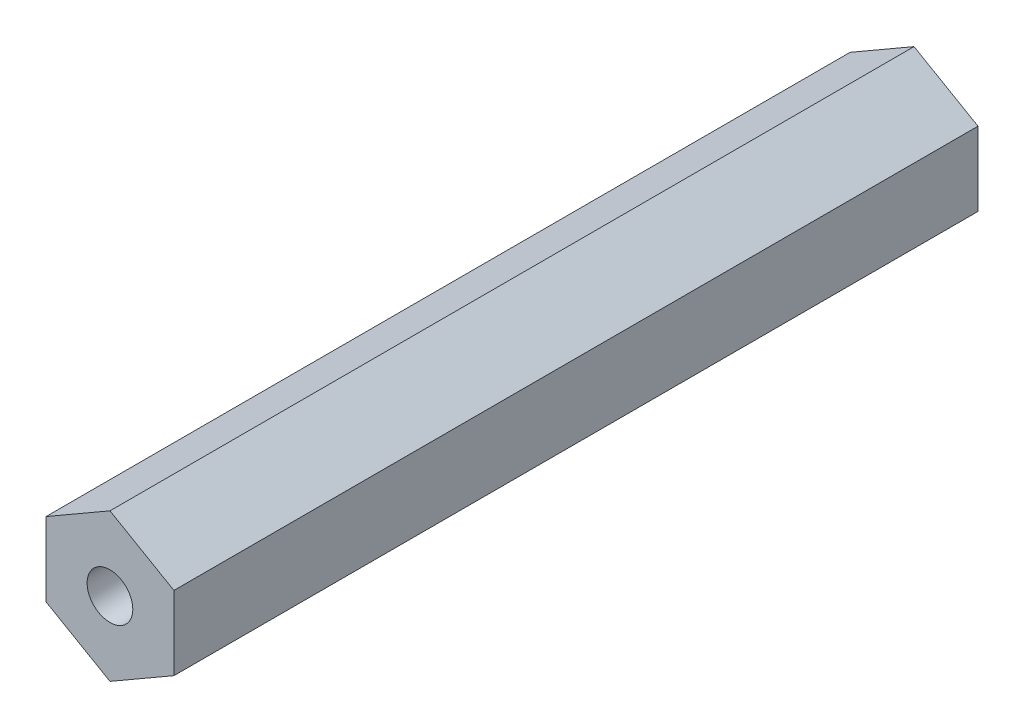
ISO-10303-21;
HEADER;
FILE_DESCRIPTION(('STEP AP214'),'2;1');
FILE_NAME('part.step','',(''),(''),'','','');
FILE_SCHEMA(('AUTOMOTIVE_DESIGN { 1 0 10303 214 1 1 1 1 }'));
ENDSEC;
DATA;
#1=APPLICATION_CONTEXT('core data for automotive mechanical design processes');
#2=APPLICATION_PROTOCOL_DEFINITION('international standard','automotive_design',2000,#1);
#3=PRODUCT_CONTEXT('',#1,'mechanical');
#4=PRODUCT('Part','Part','',(#3));
#5=PRODUCT_RELATED_PRODUCT_CATEGORY('part','',(#4));
#6=PRODUCT_DEFINITION_FORMATION('','',#4);
#7=PRODUCT_DEFINITION_CONTEXT('part definition',#1,'design');
#8=PRODUCT_DEFINITION('design','',#6,#7);
#9=PRODUCT_DEFINITION_SHAPE('','',#8);
#10=(LENGTH_UNIT() NAMED_UNIT(*) SI_UNIT(.MILLI.,.METRE.));
#11=(NAMED_UNIT(*) PLANE_ANGLE_UNIT() SI_UNIT($,.RADIAN.));
#12=(NAMED_UNIT(*) SI_UNIT($,.STERADIAN.) SOLID_ANGLE_UNIT());
#13=UNCERTAINTY_MEASURE_WITH_UNIT(LENGTH_MEASURE(1.E-05),#10,'distance_accuracy_value','');
#14=(GEOMETRIC_REPRESENTATION_CONTEXT(3) GLOBAL_UNCERTAINTY_ASSIGNED_CONTEXT((#13)) GLOBAL_UNIT_ASSIGNED_CONTEXT((#10,
#11,#12)) REPRESENTATION_CONTEXT('',''));
#15=CARTESIAN_POINT('',(0.,0.,0.));
#16=DIRECTION('',(0.,0.,1.));
#17=DIRECTION('',(1.,0.,0.));
#18=AXIS2_PLACEMENT_3D('',#15,#16,#17);
#19=CARTESIAN_POINT('',(-3.5,-2.02072594216369,44.));
#20=DIRECTION('',(0.5,0.866025403784439,0.));
#21=DIRECTION('',(-0.866025403784439,0.5,0.));
#22=AXIS2_PLACEMENT_3D('',#19,#20,#21);
#23=PLANE('',#22);
#24=DIRECTION('',(0.866025403784439,-0.5,0.));
#25=VECTOR('',#24,1.);
#26=CARTESIAN_POINT('',(-3.5,-2.02072594216369,0.));
#27=LINE('',#26,#25);
#28=CARTESIAN_POINT('',(-3.5,-2.02072594216369,0.));
#29=VERTEX_POINT('',#28);
#30=CARTESIAN_POINT('',(0.,-4.04145188432738,0.));
#31=VERTEX_POINT('',#30);
#32=EDGE_CURVE('E128',#29,#31,#27,.T.);
#33=ORIENTED_EDGE('',*,*,#32,.T.);
#34=DIRECTION('',(0.,0.,-1.));
#35=VECTOR('',#34,1.);
#36=CARTESIAN_POINT('',(0.,-4.04145188432738,44.));
#37=LINE('',#36,#35);
#38=CARTESIAN_POINT('',(0.,-4.04145188432738,44.));
#39=VERTEX_POINT('',#38);
#40=EDGE_CURVE('E11',#39,#31,#37,.T.);
#41=ORIENTED_EDGE('',*,*,#40,.F.);
#42=DIRECTION('',(0.866025403784439,-0.5,0.));
#43=VECTOR('',#42,1.);
#44=CARTESIAN_POINT('',(-3.5,-2.02072594216369,44.));
#45=LINE('',#44,#43);
#46=CARTESIAN_POINT('',(-3.5,-2.02072594216369,44.));
#47=VERTEX_POINT('',#46);
#48=EDGE_CURVE('E145',#47,#39,#45,.T.);
#49=ORIENTED_EDGE('',*,*,#48,.F.);
#50=DIRECTION('',(0.,0.,-1.));
#51=VECTOR('',#50,1.);
#52=CARTESIAN_POINT('',(-3.5,-2.02072594216369,44.));
#53=LINE('',#52,#51);
#54=EDGE_CURVE('E124',#47,#29,#53,.T.);
#55=ORIENTED_EDGE('',*,*,#54,.T.);
#56=EDGE_LOOP('',(#33,#41,#49,#55));
#57=FACE_BOUND('',#56,.T.);
#58=ADVANCED_FACE('F39',(#57),#23,.F.);
#59=CARTESIAN_POINT('',(0.,-4.04145188432738,44.));
#60=DIRECTION('',(-0.5,0.866025403784439,0.));
#61=DIRECTION('',(-0.866025403784439,-0.5,0.));
#62=AXIS2_PLACEMENT_3D('',#59,#60,#61);
#63=PLANE('',#62);
#64=DIRECTION('',(0.866025403784439,0.5,0.));
#65=VECTOR('',#64,1.);
#66=CARTESIAN_POINT('',(0.,-4.04145188432738,0.));
#67=LINE('',#66,#65);
#68=CARTESIAN_POINT('',(3.5,-2.02072594216369,0.));
#69=VERTEX_POINT('',#68);
#70=EDGE_CURVE('E132',#31,#69,#67,.T.);
#71=ORIENTED_EDGE('',*,*,#70,.T.);
#72=DIRECTION('',(0.,0.,-1.));
#73=VECTOR('',#72,1.);
#74=CARTESIAN_POINT('',(3.5,-2.02072594216369,44.));
#75=LINE('',#74,#73);
#76=CARTESIAN_POINT('',(3.5,-2.02072594216369,44.));
#77=VERTEX_POINT('',#76);
#78=EDGE_CURVE('E48',#77,#69,#75,.T.);
#79=ORIENTED_EDGE('',*,*,#78,.F.);
#80=DIRECTION('',(0.866025403784439,0.5,0.));
#81=VECTOR('',#80,1.);
#82=CARTESIAN_POINT('',(0.,-4.04145188432738,44.));
#83=LINE('',#82,#81);
#84=EDGE_CURVE('E93',#39,#77,#83,.T.);
#85=ORIENTED_EDGE('',*,*,#84,.F.);
#86=ORIENTED_EDGE('',*,*,#40,.T.);
#87=EDGE_LOOP('',(#71,#79,#85,#86));
#88=FACE_BOUND('',#87,.T.);
#89=ADVANCED_FACE('F174',(#88),#63,.F.);
#90=CARTESIAN_POINT('',(3.5,-2.02072594216369,44.));
#91=DIRECTION('',(-1.,0.,0.));
#92=DIRECTION('',(0.,-1.,0.));
#93=AXIS2_PLACEMENT_3D('',#90,#91,#92);
#94=PLANE('',#93);
#95=DIRECTION('',(0.,1.,0.));
#96=VECTOR('',#95,1.);
#97=CARTESIAN_POINT('',(3.5,-2.02072594216369,0.));
#98=LINE('',#97,#96);
#99=CARTESIAN_POINT('',(3.5,2.0207259421637,0.));
#100=VERTEX_POINT('',#99);
#101=EDGE_CURVE('E136',#69,#100,#98,.T.);
#102=ORIENTED_EDGE('',*,*,#101,.T.);
#103=DIRECTION('',(0.,0.,-1.));
#104=VECTOR('',#103,1.);
#105=CARTESIAN_POINT('',(3.5,2.0207259421637,44.));
#106=LINE('',#105,#104);
#107=CARTESIAN_POINT('',(3.5,2.0207259421637,44.));
#108=VERTEX_POINT('',#107);
#109=EDGE_CURVE('E117',#108,#100,#106,.T.);
#110=ORIENTED_EDGE('',*,*,#109,.F.);
#111=DIRECTION('',(0.,1.,0.));
#112=VECTOR('',#111,1.);
#113=CARTESIAN_POINT('',(3.5,-2.02072594216369,44.));
#114=LINE('',#113,#112);
#115=EDGE_CURVE('E106',#77,#108,#114,.T.);
#116=ORIENTED_EDGE('',*,*,#115,.F.);
#117=ORIENTED_EDGE('',*,*,#78,.T.);
#118=EDGE_LOOP('',(#102,#110,#116,#117));
#119=FACE_BOUND('',#118,.T.);
#120=ADVANCED_FACE('F155',(#119),#94,.F.);
#121=CARTESIAN_POINT('',(3.5,2.0207259421637,44.));
#122=DIRECTION('',(-0.5,-0.866025403784439,0.));
#123=DIRECTION('',(0.866025403784439,-0.5,0.));
#124=AXIS2_PLACEMENT_3D('',#121,#122,#123);
#125=PLANE('',#124);
#126=DIRECTION('',(-0.866025403784439,0.5,0.));
#127=VECTOR('',#126,1.);
#128=CARTESIAN_POINT('',(3.5,2.0207259421637,0.));
#129=LINE('',#128,#127);
#130=CARTESIAN_POINT('',(0.,4.04145188432738,0.));
#131=VERTEX_POINT('',#130);
#132=EDGE_CURVE('E115',#100,#131,#129,.T.);
#133=ORIENTED_EDGE('',*,*,#132,.T.);
#134=DIRECTION('',(0.,0.,-1.));
#135=VECTOR('',#134,1.);
#136=CARTESIAN_POINT('',(0.,4.04145188432738,44.));
#137=LINE('',#136,#135);
#138=CARTESIAN_POINT('',(0.,4.04145188432738,44.));
#139=VERTEX_POINT('',#138);
#140=EDGE_CURVE('E112',#139,#131,#137,.T.);
#141=ORIENTED_EDGE('',*,*,#140,.F.);
#142=DIRECTION('',(-0.866025403784439,0.5,0.));
#143=VECTOR('',#142,1.);
#144=CARTESIAN_POINT('',(3.5,2.0207259421637,44.));
#145=LINE('',#144,#143);
#146=EDGE_CURVE('E100',#108,#139,#145,.T.);
#147=ORIENTED_EDGE('',*,*,#146,.F.);
#148=ORIENTED_EDGE('',*,*,#109,.T.);
#149=EDGE_LOOP('',(#133,#141,#147,#148));
#150=FACE_BOUND('',#149,.T.);
#151=ADVANCED_FACE('F113',(#150),#125,.F.);
#152=CARTESIAN_POINT('',(0.,4.04145188432738,44.));
#153=DIRECTION('',(0.5,-0.866025403784439,0.));
#154=DIRECTION('',(0.866025403784439,0.5,0.));
#155=AXIS2_PLACEMENT_3D('',#152,#153,#154);
#156=PLANE('',#155);
#157=DIRECTION('',(-0.866025403784439,-0.499999999999999,0.));
#158=VECTOR('',#157,1.);
#159=CARTESIAN_POINT('',(0.,4.04145188432738,0.));
#160=LINE('',#159,#158);
#161=CARTESIAN_POINT('',(-3.5,2.0207259421637,0.));
#162=VERTEX_POINT('',#161);
#163=EDGE_CURVE('E79',#131,#162,#160,.T.);
#164=ORIENTED_EDGE('',*,*,#163,.T.);
#165=DIRECTION('',(0.,0.,-1.));
#166=VECTOR('',#165,1.);
#167=CARTESIAN_POINT('',(-3.5,2.0207259421637,44.));
#168=LINE('',#167,#166);
#169=CARTESIAN_POINT('',(-3.5,2.0207259421637,44.));
#170=VERTEX_POINT('',#169);
#171=EDGE_CURVE('E118',#170,#162,#168,.T.);
#172=ORIENTED_EDGE('',*,*,#171,.F.);
#173=DIRECTION('',(-0.866025403784439,-0.499999999999999,0.));
#174=VECTOR('',#173,1.);
#175=CARTESIAN_POINT('',(0.,4.04145188432738,44.));
#176=LINE('',#175,#174);
#177=EDGE_CURVE('E104',#139,#170,#176,.T.);
#178=ORIENTED_EDGE('',*,*,#177,.F.);
#179=ORIENTED_EDGE('',*,*,#140,.T.);
#180=EDGE_LOOP('',(#164,#172,#178,#179));
#181=FACE_BOUND('',#180,.T.);
#182=ADVANCED_FACE('F120',(#181),#156,.F.);
#183=CARTESIAN_POINT('',(-3.5,2.0207259421637,44.));
#184=DIRECTION('',(1.,0.,0.));
#185=DIRECTION('',(0.,1.,0.));
#186=AXIS2_PLACEMENT_3D('',#183,#184,#185);
#187=PLANE('',#186);
#188=DIRECTION('',(0.,-1.,0.));
#189=VECTOR('',#188,1.);
#190=CARTESIAN_POINT('',(-3.5,2.0207259421637,0.));
#191=LINE('',#190,#189);
#192=EDGE_CURVE('E85',#162,#29,#191,.T.);
#193=ORIENTED_EDGE('',*,*,#192,.T.);
#194=ORIENTED_EDGE('',*,*,#54,.F.);
#195=DIRECTION('',(0.,-1.,0.));
#196=VECTOR('',#195,1.);
#197=CARTESIAN_POINT('',(-3.5,2.0207259421637,44.));
#198=LINE('',#197,#196);
#199=EDGE_CURVE('E56',#170,#47,#198,.T.);
#200=ORIENTED_EDGE('',*,*,#199,.F.);
#201=ORIENTED_EDGE('',*,*,#171,.T.);
#202=EDGE_LOOP('',(#193,#194,#200,#201));
#203=FACE_BOUND('',#202,.T.);
#204=ADVANCED_FACE('F162',(#203),#187,.F.);
#205=CARTESIAN_POINT('',(0.,0.,44.));
#206=DIRECTION('',(0.,0.,1.));
#207=DIRECTION('',(1.,0.,0.));
#208=AXIS2_PLACEMENT_3D('',#205,#206,#207);
#209=PLANE('',#208);
#210=CARTESIAN_POINT('',(0.,0.,44.));
#211=DIRECTION('',(0.,0.,1.));
#212=DIRECTION('',(1.,0.,0.));
#213=AXIS2_PLACEMENT_3D('',#210,#211,#212);
#214=CIRCLE('',#213,1.25);
#215=CARTESIAN_POINT('',(1.25,0.,44.));
#216=VERTEX_POINT('',#215);
#217=EDGE_CURVE('E258',#216,#216,#214,.T.);
#218=ORIENTED_EDGE('',*,*,#217,.F.);
#219=EDGE_LOOP('',(#218));
#220=FACE_BOUND('',#219,.T.);
#221=ORIENTED_EDGE('',*,*,#48,.T.);
#222=ORIENTED_EDGE('',*,*,#84,.T.);
#223=ORIENTED_EDGE('',*,*,#115,.T.);
#224=ORIENTED_EDGE('',*,*,#146,.T.);
#225=ORIENTED_EDGE('',*,*,#177,.T.);
#226=ORIENTED_EDGE('',*,*,#199,.T.);
#227=EDGE_LOOP('',(#221,#222,#223,#224,#225,#226));
#228=FACE_BOUND('',#227,.T.);
#229=ADVANCED_FACE('F102',(#220,#228),#209,.T.);
#230=CARTESIAN_POINT('',(0.,0.,0.));
#231=DIRECTION('',(0.,0.,1.));
#232=DIRECTION('',(1.,0.,0.));
#233=AXIS2_PLACEMENT_3D('',#230,#231,#232);
#234=PLANE('',#233);
#235=CARTESIAN_POINT('',(0.,0.,0.));
#236=DIRECTION('',(0.,0.,-1.));
#237=DIRECTION('',(-1.,0.,0.));
#238=AXIS2_PLACEMENT_3D('',#235,#236,#237);
#239=CIRCLE('',#238,1.25);
#240=CARTESIAN_POINT('',(-1.25,0.,0.));
#241=VERTEX_POINT('',#240);
#242=EDGE_CURVE('E259',#241,#241,#239,.T.);
#243=ORIENTED_EDGE('',*,*,#242,.F.);
#244=EDGE_LOOP('',(#243));
#245=FACE_BOUND('',#244,.T.);
#246=ORIENTED_EDGE('',*,*,#32,.F.);
#247=ORIENTED_EDGE('',*,*,#192,.F.);
#248=ORIENTED_EDGE('',*,*,#163,.F.);
#249=ORIENTED_EDGE('',*,*,#132,.F.);
#250=ORIENTED_EDGE('',*,*,#101,.F.);
#251=ORIENTED_EDGE('',*,*,#70,.F.);
#252=EDGE_LOOP('',(#246,#247,#248,#249,#250,#251));
#253=FACE_BOUND('',#252,.T.);
#254=ADVANCED_FACE('F158',(#245,#253),#234,.F.);
#255=CARTESIAN_POINT('',(0.,0.,39.));
#256=DIRECTION('',(0.,0.,1.));
#257=DIRECTION('',(1.,0.,0.));
#258=AXIS2_PLACEMENT_3D('',#255,#256,#257);
#259=CYLINDRICAL_SURFACE('',#258,1.25);
#260=CARTESIAN_POINT('',(0.,0.,39.));
#261=DIRECTION('',(0.,0.,1.));
#262=DIRECTION('',(1.,0.,0.));
#263=AXIS2_PLACEMENT_3D('',#260,#261,#262);
#264=CIRCLE('',#263,1.25);
#265=CARTESIAN_POINT('',(1.25,0.,39.));
#266=VERTEX_POINT('',#265);
#267=EDGE_CURVE('E133',#266,#266,#264,.T.);
#268=ORIENTED_EDGE('',*,*,#267,.F.);
#269=EDGE_LOOP('',(#268));
#270=FACE_BOUND('',#269,.T.);
#271=ORIENTED_EDGE('',*,*,#217,.T.);
#272=EDGE_LOOP('',(#271));
#273=FACE_BOUND('',#272,.T.);
#274=ADVANCED_FACE('F209',(#270,#273),#259,.F.);
#275=CARTESIAN_POINT('',(0.,0.,39.));
#276=DIRECTION('',(0.,0.,1.));
#277=DIRECTION('',(1.,0.,0.));
#278=AXIS2_PLACEMENT_3D('',#275,#276,#277);
#279=PLANE('',#278);
#280=ORIENTED_EDGE('',*,*,#267,.T.);
#281=EDGE_LOOP('',(#280));
#282=FACE_BOUND('',#281,.T.);
#283=ADVANCED_FACE('F214',(#282),#279,.T.);
#284=CARTESIAN_POINT('',(0.,0.,5.));
#285=DIRECTION('',(0.,0.,-1.));
#286=DIRECTION('',(-1.,0.,0.));
#287=AXIS2_PLACEMENT_3D('',#284,#285,#286);
#288=CYLINDRICAL_SURFACE('',#287,1.25);
#289=CARTESIAN_POINT('',(0.,0.,5.));
#290=DIRECTION('',(0.,0.,-1.));
#291=DIRECTION('',(-1.,0.,0.));
#292=AXIS2_PLACEMENT_3D('',#289,#290,#291);
#293=CIRCLE('',#292,1.25);
#294=CARTESIAN_POINT('',(-1.25,0.,5.));
#295=VERTEX_POINT('',#294);
#296=EDGE_CURVE('E256',#295,#295,#293,.T.);
#297=ORIENTED_EDGE('',*,*,#296,.F.);
#298=EDGE_LOOP('',(#297));
#299=FACE_BOUND('',#298,.T.);
#300=ORIENTED_EDGE('',*,*,#242,.T.);
#301=EDGE_LOOP('',(#300));
#302=FACE_BOUND('',#301,.T.);
#303=ADVANCED_FACE('F224',(#299,#302),#288,.F.);
#304=CARTESIAN_POINT('',(0.,0.,5.));
#305=DIRECTION('',(0.,0.,-1.));
#306=DIRECTION('',(-1.,0.,0.));
#307=AXIS2_PLACEMENT_3D('',#304,#305,#306);
#308=PLANE('',#307);
#309=ORIENTED_EDGE('',*,*,#296,.T.);
#310=EDGE_LOOP('',(#309));
#311=FACE_BOUND('',#310,.T.);
#312=ADVANCED_FACE('F240',(#311),#308,.T.);
#313=CLOSED_SHELL('',(#58,#89,#120,#151,#182,#204,#229,#254,#274,#283,#303,#312));
#314=MANIFOLD_SOLID_BREP('B2',#313);
#315=ADVANCED_BREP_SHAPE_REPRESENTATION('',(#18,#314),#14);
#316=SHAPE_DEFINITION_REPRESENTATION(#9,#315);
ENDSEC;
END-ISO-10303-21;
